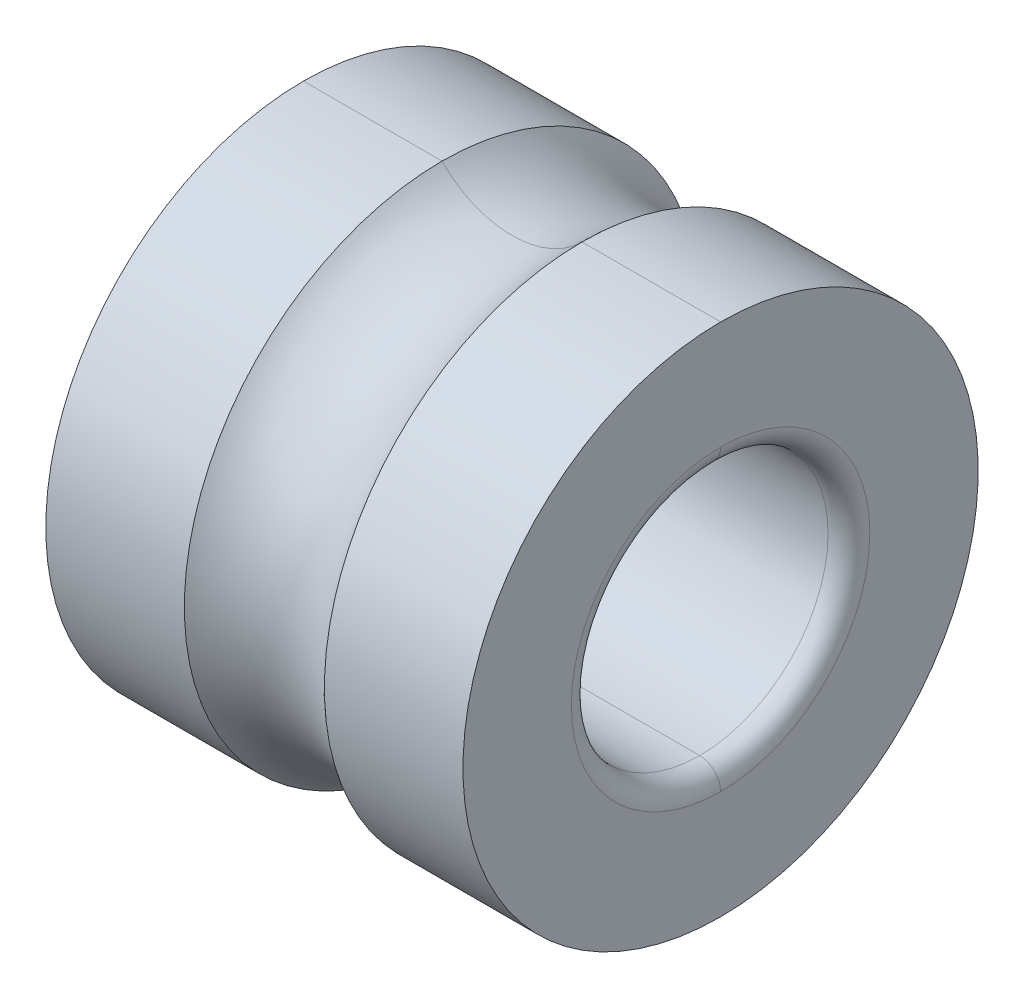
ISO-10303-21;
HEADER;
FILE_DESCRIPTION(('STEP AP214'),'2;1');
FILE_NAME('part.step','',(''),(''),'','','');
FILE_SCHEMA(('AUTOMOTIVE_DESIGN { 1 0 10303 214 1 1 1 1 }'));
ENDSEC;
DATA;
#1=APPLICATION_CONTEXT('core data for automotive mechanical design processes');
#2=APPLICATION_PROTOCOL_DEFINITION('international standard','automotive_design',2000,#1);
#3=PRODUCT_CONTEXT('',#1,'mechanical');
#4=PRODUCT('Part','Part','',(#3));
#5=PRODUCT_RELATED_PRODUCT_CATEGORY('part','',(#4));
#6=PRODUCT_DEFINITION_FORMATION('','',#4);
#7=PRODUCT_DEFINITION_CONTEXT('part definition',#1,'design');
#8=PRODUCT_DEFINITION('design','',#6,#7);
#9=PRODUCT_DEFINITION_SHAPE('','',#8);
#10=(LENGTH_UNIT() NAMED_UNIT(*) SI_UNIT(.MILLI.,.METRE.));
#11=(NAMED_UNIT(*) PLANE_ANGLE_UNIT() SI_UNIT($,.RADIAN.));
#12=(NAMED_UNIT(*) SI_UNIT($,.STERADIAN.) SOLID_ANGLE_UNIT());
#13=UNCERTAINTY_MEASURE_WITH_UNIT(LENGTH_MEASURE(1.E-05),#10,'distance_accuracy_value','');
#14=(GEOMETRIC_REPRESENTATION_CONTEXT(3) GLOBAL_UNCERTAINTY_ASSIGNED_CONTEXT((#13)) GLOBAL_UNIT_ASSIGNED_CONTEXT((#10,
#11,#12)) REPRESENTATION_CONTEXT('',''));
#15=CARTESIAN_POINT('',(0.,0.,0.));
#16=DIRECTION('',(0.,0.,1.));
#17=DIRECTION('',(1.,0.,0.));
#18=AXIS2_PLACEMENT_3D('',#15,#16,#17);
#19=CARTESIAN_POINT('',(-0.544829999999999,0.,0.));
#20=DIRECTION('',(1.,0.,0.));
#21=DIRECTION('',(0.,-1.,0.));
#22=AXIS2_PLACEMENT_3D('',#19,#20,#21);
#23=CYLINDRICAL_SURFACE('',#22,0.3048);
#24=CARTESIAN_POINT('',(-0.44577,0.,0.));
#25=DIRECTION('',(-1.,0.,0.));
#26=DIRECTION('',(0.,1.,0.));
#27=AXIS2_PLACEMENT_3D('',#24,#25,#26);
#28=CIRCLE('',#27,0.3048);
#29=CARTESIAN_POINT('',(-0.44577,0.3048,0.));
#30=VERTEX_POINT('',#29);
#31=CARTESIAN_POINT('',(-0.44577,-0.3048,0.));
#32=VERTEX_POINT('',#31);
#33=EDGE_CURVE('E18',#30,#32,#28,.T.);
#34=ORIENTED_EDGE('',*,*,#33,.T.);
#35=DIRECTION('',(1.,0.,0.));
#36=VECTOR('',#35,1.);
#37=CARTESIAN_POINT('',(-0.44577,-0.3048,0.));
#38=LINE('',#37,#36);
#39=CARTESIAN_POINT('',(0.44577,-0.3048,0.));
#40=VERTEX_POINT('',#39);
#41=EDGE_CURVE('E10',#32,#40,#38,.T.);
#42=ORIENTED_EDGE('',*,*,#41,.T.);
#43=CARTESIAN_POINT('',(0.44577,0.,0.));
#44=DIRECTION('',(-1.,0.,0.));
#45=DIRECTION('',(0.,1.,0.));
#46=AXIS2_PLACEMENT_3D('',#43,#44,#45);
#47=CIRCLE('',#46,0.3048);
#48=CARTESIAN_POINT('',(0.44577,0.3048,0.));
#49=VERTEX_POINT('',#48);
#50=EDGE_CURVE('E83',#49,#40,#47,.T.);
#51=ORIENTED_EDGE('',*,*,#50,.F.);
#52=DIRECTION('',(1.,0.,0.));
#53=VECTOR('',#52,1.);
#54=CARTESIAN_POINT('',(-0.44577,0.3048,0.));
#55=LINE('',#54,#53);
#56=EDGE_CURVE('E23',#30,#49,#55,.T.);
#57=ORIENTED_EDGE('',*,*,#56,.F.);
#58=EDGE_LOOP('',(#34,#42,#51,#57));
#59=FACE_BOUND('',#58,.T.);
#60=ADVANCED_FACE('F15',(#59),#23,.F.);
#61=CARTESIAN_POINT('',(-0.544829999999999,0.,0.));
#62=DIRECTION('',(1.,0.,0.));
#63=DIRECTION('',(0.,-1.,0.));
#64=AXIS2_PLACEMENT_3D('',#61,#62,#63);
#65=CYLINDRICAL_SURFACE('',#64,0.3048);
#66=CARTESIAN_POINT('',(0.44577,0.,0.));
#67=DIRECTION('',(1.,0.,0.));
#68=DIRECTION('',(0.,1.,0.));
#69=AXIS2_PLACEMENT_3D('',#66,#67,#68);
#70=CIRCLE('',#69,0.3048);
#71=EDGE_CURVE('E87',#49,#40,#70,.T.);
#72=ORIENTED_EDGE('',*,*,#71,.T.);
#73=ORIENTED_EDGE('',*,*,#41,.F.);
#74=CARTESIAN_POINT('',(-0.44577,0.,0.));
#75=DIRECTION('',(1.,0.,0.));
#76=DIRECTION('',(0.,1.,0.));
#77=AXIS2_PLACEMENT_3D('',#74,#75,#76);
#78=CIRCLE('',#77,0.3048);
#79=EDGE_CURVE('E90',#30,#32,#78,.T.);
#80=ORIENTED_EDGE('',*,*,#79,.F.);
#81=ORIENTED_EDGE('',*,*,#56,.T.);
#82=EDGE_LOOP('',(#72,#73,#80,#81));
#83=FACE_BOUND('',#82,.T.);
#84=ADVANCED_FACE('F92',(#83),#65,.F.);
#85=CARTESIAN_POINT('',(0.44577,0.,0.));
#86=DIRECTION('',(1.,0.,0.));
#87=DIRECTION('',(0.,-1.,0.));
#88=AXIS2_PLACEMENT_3D('',#85,#86,#87);
#89=TOROIDAL_SURFACE('',#88,0.35433,0.04953);
#90=CARTESIAN_POINT('',(0.4953,0.,0.));
#91=DIRECTION('',(1.,0.,0.));
#92=DIRECTION('',(0.,1.,0.));
#93=AXIS2_PLACEMENT_3D('',#90,#91,#92);
#94=CIRCLE('',#93,0.35433);
#95=CARTESIAN_POINT('',(0.4953,0.35433,0.));
#96=VERTEX_POINT('',#95);
#97=CARTESIAN_POINT('',(0.4953,-0.35433,0.));
#98=VERTEX_POINT('',#97);
#99=EDGE_CURVE('E146',#96,#98,#94,.T.);
#100=ORIENTED_EDGE('',*,*,#99,.T.);
#101=CARTESIAN_POINT('',(0.44577,-0.35433,0.));
#102=DIRECTION('',(0.,0.,-1.));
#103=DIRECTION('',(0.,1.,0.));
#104=AXIS2_PLACEMENT_3D('',#101,#102,#103);
#105=CIRCLE('',#104,0.04953);
#106=EDGE_CURVE('E150',#40,#98,#105,.T.);
#107=ORIENTED_EDGE('',*,*,#106,.F.);
#108=ORIENTED_EDGE('',*,*,#71,.F.);
#109=CARTESIAN_POINT('',(0.44577,0.35433,0.));
#110=DIRECTION('',(0.,0.,1.));
#111=DIRECTION('',(0.,-1.,0.));
#112=AXIS2_PLACEMENT_3D('',#109,#110,#111);
#113=CIRCLE('',#112,0.04953);
#114=EDGE_CURVE('E148',#49,#96,#113,.T.);
#115=ORIENTED_EDGE('',*,*,#114,.T.);
#116=EDGE_LOOP('',(#100,#107,#108,#115));
#117=FACE_BOUND('',#116,.T.);
#118=ADVANCED_FACE('F157',(#117),#89,.T.);
#119=CARTESIAN_POINT('',(0.44577,0.,0.));
#120=DIRECTION('',(1.,0.,0.));
#121=DIRECTION('',(0.,-1.,0.));
#122=AXIS2_PLACEMENT_3D('',#119,#120,#121);
#123=TOROIDAL_SURFACE('',#122,0.35433,0.04953);
#124=ORIENTED_EDGE('',*,*,#50,.T.);
#125=ORIENTED_EDGE('',*,*,#106,.T.);
#126=CARTESIAN_POINT('',(0.4953,0.,0.));
#127=DIRECTION('',(-1.,0.,0.));
#128=DIRECTION('',(0.,1.,0.));
#129=AXIS2_PLACEMENT_3D('',#126,#127,#128);
#130=CIRCLE('',#129,0.35433);
#131=EDGE_CURVE('E143',#96,#98,#130,.T.);
#132=ORIENTED_EDGE('',*,*,#131,.F.);
#133=ORIENTED_EDGE('',*,*,#114,.F.);
#134=EDGE_LOOP('',(#124,#125,#132,#133));
#135=FACE_BOUND('',#134,.T.);
#136=ADVANCED_FACE('F161',(#135),#123,.T.);
#137=CARTESIAN_POINT('',(0.4953,0.,0.));
#138=DIRECTION('',(1.,0.,0.));
#139=DIRECTION('',(0.,-1.,0.));
#140=AXIS2_PLACEMENT_3D('',#137,#138,#139);
#141=PLANE('',#140);
#142=ORIENTED_EDGE('',*,*,#99,.F.);
#143=ORIENTED_EDGE('',*,*,#131,.T.);
#144=EDGE_LOOP('',(#142,#143));
#145=FACE_BOUND('',#144,.T.);
#146=CARTESIAN_POINT('',(0.495300000000001,0.,0.));
#147=DIRECTION('',(-1.,0.,0.));
#148=DIRECTION('',(0.,1.,0.));
#149=AXIS2_PLACEMENT_3D('',#146,#147,#148);
#150=CIRCLE('',#149,0.6117463);
#151=CARTESIAN_POINT('',(0.4953,0.6117463,0.));
#152=VERTEX_POINT('',#151);
#153=CARTESIAN_POINT('',(0.4953,-0.6117463,0.));
#154=VERTEX_POINT('',#153);
#155=EDGE_CURVE('E138',#152,#154,#150,.T.);
#156=ORIENTED_EDGE('',*,*,#155,.F.);
#157=CARTESIAN_POINT('',(0.495300000000001,0.,0.));
#158=DIRECTION('',(1.,0.,0.));
#159=DIRECTION('',(0.,1.,0.));
#160=AXIS2_PLACEMENT_3D('',#157,#158,#159);
#161=CIRCLE('',#160,0.6117463);
#162=EDGE_CURVE('E141',#152,#154,#161,.T.);
#163=ORIENTED_EDGE('',*,*,#162,.T.);
#164=EDGE_LOOP('',(#156,#163));
#165=FACE_BOUND('',#164,.T.);
#166=ADVANCED_FACE('F163',(#145,#165),#141,.T.);
#167=CARTESIAN_POINT('',(-0.544829999999999,0.,0.));
#168=DIRECTION('',(1.,0.,0.));
#169=DIRECTION('',(0.,-1.,0.));
#170=AXIS2_PLACEMENT_3D('',#167,#168,#169);
#171=CYLINDRICAL_SURFACE('',#170,0.6117463);
#172=CARTESIAN_POINT('',(0.166246026530892,0.,0.));
#173=DIRECTION('',(1.,0.,0.));
#174=DIRECTION('',(0.,1.,0.));
#175=AXIS2_PLACEMENT_3D('',#172,#173,#174);
#176=CIRCLE('',#175,0.6117463);
#177=CARTESIAN_POINT('',(0.166246026530892,0.6117463,0.));
#178=VERTEX_POINT('',#177);
#179=CARTESIAN_POINT('',(0.166246026530892,-0.6117463,0.));
#180=VERTEX_POINT('',#179);
#181=EDGE_CURVE('E124',#178,#180,#176,.T.);
#182=ORIENTED_EDGE('',*,*,#181,.T.);
#183=DIRECTION('',(-1.,0.,0.));
#184=VECTOR('',#183,1.);
#185=CARTESIAN_POINT('',(0.4953,-0.6117463,0.));
#186=LINE('',#185,#184);
#187=EDGE_CURVE('E135',#154,#180,#186,.T.);
#188=ORIENTED_EDGE('',*,*,#187,.F.);
#189=ORIENTED_EDGE('',*,*,#162,.F.);
#190=DIRECTION('',(-1.,0.,0.));
#191=VECTOR('',#190,1.);
#192=CARTESIAN_POINT('',(0.4953,0.6117463,0.));
#193=LINE('',#192,#191);
#194=EDGE_CURVE('E133',#152,#178,#193,.T.);
#195=ORIENTED_EDGE('',*,*,#194,.T.);
#196=EDGE_LOOP('',(#182,#188,#189,#195));
#197=FACE_BOUND('',#196,.T.);
#198=ADVANCED_FACE('F166',(#197),#171,.T.);
#199=CARTESIAN_POINT('',(-0.544829999999999,0.,0.));
#200=DIRECTION('',(1.,0.,0.));
#201=DIRECTION('',(0.,-1.,0.));
#202=AXIS2_PLACEMENT_3D('',#199,#200,#201);
#203=CYLINDRICAL_SURFACE('',#202,0.6117463);
#204=ORIENTED_EDGE('',*,*,#155,.T.);
#205=ORIENTED_EDGE('',*,*,#187,.T.);
#206=CARTESIAN_POINT('',(0.166246026530892,0.,0.));
#207=DIRECTION('',(-1.,0.,0.));
#208=DIRECTION('',(0.,1.,0.));
#209=AXIS2_PLACEMENT_3D('',#206,#207,#208);
#210=CIRCLE('',#209,0.6117463);
#211=EDGE_CURVE('E130',#178,#180,#210,.T.);
#212=ORIENTED_EDGE('',*,*,#211,.F.);
#213=ORIENTED_EDGE('',*,*,#194,.F.);
#214=EDGE_LOOP('',(#204,#205,#212,#213));
#215=FACE_BOUND('',#214,.T.);
#216=ADVANCED_FACE('F174',(#215),#203,.T.);
#217=CARTESIAN_POINT('',(0.,0.,0.));
#218=DIRECTION('',(1.,0.,0.));
#219=DIRECTION('',(0.,-1.,0.));
#220=AXIS2_PLACEMENT_3D('',#217,#218,#219);
#221=TOROIDAL_SURFACE('',#220,0.7747,0.232791);
#222=ORIENTED_EDGE('',*,*,#211,.T.);
#223=CARTESIAN_POINT('',(0.,-0.7747,0.));
#224=DIRECTION('',(0.,0.,1.));
#225=DIRECTION('',(0.714142842854284,0.700000000000001,0.));
#226=AXIS2_PLACEMENT_3D('',#223,#224,#225);
#227=CIRCLE('',#226,0.232791);
#228=CARTESIAN_POINT('',(-0.166246026530892,-0.6117463,0.));
#229=VERTEX_POINT('',#228);
#230=EDGE_CURVE('E126',#180,#229,#227,.T.);
#231=ORIENTED_EDGE('',*,*,#230,.T.);
#232=CARTESIAN_POINT('',(-0.166246026530892,0.,0.));
#233=DIRECTION('',(-1.,0.,0.));
#234=DIRECTION('',(0.,1.,0.));
#235=AXIS2_PLACEMENT_3D('',#232,#233,#234);
#236=CIRCLE('',#235,0.6117463);
#237=CARTESIAN_POINT('',(-0.166246026530892,0.6117463,0.));
#238=VERTEX_POINT('',#237);
#239=EDGE_CURVE('E117',#238,#229,#236,.T.);
#240=ORIENTED_EDGE('',*,*,#239,.F.);
#241=CARTESIAN_POINT('',(0.,0.7747,0.));
#242=DIRECTION('',(0.,0.,-1.));
#243=DIRECTION('',(0.714142842854284,-0.700000000000001,0.));
#244=AXIS2_PLACEMENT_3D('',#241,#242,#243);
#245=CIRCLE('',#244,0.232791);
#246=EDGE_CURVE('E123',#178,#238,#245,.T.);
#247=ORIENTED_EDGE('',*,*,#246,.F.);
#248=EDGE_LOOP('',(#222,#231,#240,#247));
#249=FACE_BOUND('',#248,.T.);
#250=ADVANCED_FACE('F179',(#249),#221,.F.);
#251=CARTESIAN_POINT('',(0.,0.,0.));
#252=DIRECTION('',(1.,0.,0.));
#253=DIRECTION('',(0.,-1.,0.));
#254=AXIS2_PLACEMENT_3D('',#251,#252,#253);
#255=TOROIDAL_SURFACE('',#254,0.7747,0.232791);
#256=CARTESIAN_POINT('',(-0.166246026530892,0.,0.));
#257=DIRECTION('',(1.,0.,0.));
#258=DIRECTION('',(0.,1.,0.));
#259=AXIS2_PLACEMENT_3D('',#256,#257,#258);
#260=CIRCLE('',#259,0.6117463);
#261=EDGE_CURVE('E120',#238,#229,#260,.T.);
#262=ORIENTED_EDGE('',*,*,#261,.T.);
#263=ORIENTED_EDGE('',*,*,#230,.F.);
#264=ORIENTED_EDGE('',*,*,#181,.F.);
#265=ORIENTED_EDGE('',*,*,#246,.T.);
#266=EDGE_LOOP('',(#262,#263,#264,#265));
#267=FACE_BOUND('',#266,.T.);
#268=ADVANCED_FACE('F182',(#267),#255,.F.);
#269=CARTESIAN_POINT('',(-0.544829999999999,0.,0.));
#270=DIRECTION('',(1.,0.,0.));
#271=DIRECTION('',(0.,-1.,0.));
#272=AXIS2_PLACEMENT_3D('',#269,#270,#271);
#273=CYLINDRICAL_SURFACE('',#272,0.6117463);
#274=CARTESIAN_POINT('',(-0.4953,0.,0.));
#275=DIRECTION('',(1.,0.,0.));
#276=DIRECTION('',(0.,1.,0.));
#277=AXIS2_PLACEMENT_3D('',#274,#275,#276);
#278=CIRCLE('',#277,0.6117463);
#279=CARTESIAN_POINT('',(-0.4953,0.6117463,0.));
#280=VERTEX_POINT('',#279);
#281=CARTESIAN_POINT('',(-0.4953,-0.6117463,0.));
#282=VERTEX_POINT('',#281);
#283=EDGE_CURVE('E37',#280,#282,#278,.T.);
#284=ORIENTED_EDGE('',*,*,#283,.T.);
#285=DIRECTION('',(-1.,0.,0.));
#286=VECTOR('',#285,1.);
#287=CARTESIAN_POINT('',(-0.166246026530892,-0.6117463,0.));
#288=LINE('',#287,#286);
#289=EDGE_CURVE('E115',#229,#282,#288,.T.);
#290=ORIENTED_EDGE('',*,*,#289,.F.);
#291=ORIENTED_EDGE('',*,*,#261,.F.);
#292=DIRECTION('',(-1.,0.,0.));
#293=VECTOR('',#292,1.);
#294=CARTESIAN_POINT('',(-0.166246026530892,0.6117463,0.));
#295=LINE('',#294,#293);
#296=EDGE_CURVE('E113',#238,#280,#295,.T.);
#297=ORIENTED_EDGE('',*,*,#296,.T.);
#298=EDGE_LOOP('',(#284,#290,#291,#297));
#299=FACE_BOUND('',#298,.T.);
#300=ADVANCED_FACE('F184',(#299),#273,.T.);
#301=CARTESIAN_POINT('',(-0.544829999999999,0.,0.));
#302=DIRECTION('',(1.,0.,0.));
#303=DIRECTION('',(0.,-1.,0.));
#304=AXIS2_PLACEMENT_3D('',#301,#302,#303);
#305=CYLINDRICAL_SURFACE('',#304,0.6117463);
#306=ORIENTED_EDGE('',*,*,#239,.T.);
#307=ORIENTED_EDGE('',*,*,#289,.T.);
#308=CARTESIAN_POINT('',(-0.4953,0.,0.));
#309=DIRECTION('',(-1.,0.,0.));
#310=DIRECTION('',(0.,1.,0.));
#311=AXIS2_PLACEMENT_3D('',#308,#309,#310);
#312=CIRCLE('',#311,0.6117463);
#313=EDGE_CURVE('E95',#280,#282,#312,.T.);
#314=ORIENTED_EDGE('',*,*,#313,.F.);
#315=ORIENTED_EDGE('',*,*,#296,.F.);
#316=EDGE_LOOP('',(#306,#307,#314,#315));
#317=FACE_BOUND('',#316,.T.);
#318=ADVANCED_FACE('F187',(#317),#305,.T.);
#319=CARTESIAN_POINT('',(-0.4953,0.,0.));
#320=DIRECTION('',(1.,0.,0.));
#321=DIRECTION('',(0.,-1.,0.));
#322=AXIS2_PLACEMENT_3D('',#319,#320,#321);
#323=PLANE('',#322);
#324=CARTESIAN_POINT('',(-0.4953,0.,0.));
#325=DIRECTION('',(-1.,0.,0.));
#326=DIRECTION('',(0.,1.,0.));
#327=AXIS2_PLACEMENT_3D('',#324,#325,#326);
#328=CIRCLE('',#327,0.35433);
#329=CARTESIAN_POINT('',(-0.4953,0.35433,0.));
#330=VERTEX_POINT('',#329);
#331=CARTESIAN_POINT('',(-0.4953,-0.35433,0.));
#332=VERTEX_POINT('',#331);
#333=EDGE_CURVE('E105',#330,#332,#328,.T.);
#334=ORIENTED_EDGE('',*,*,#333,.F.);
#335=CARTESIAN_POINT('',(-0.4953,0.,0.));
#336=DIRECTION('',(1.,0.,0.));
#337=DIRECTION('',(0.,1.,0.));
#338=AXIS2_PLACEMENT_3D('',#335,#336,#337);
#339=CIRCLE('',#338,0.35433);
#340=EDGE_CURVE('E29',#330,#332,#339,.T.);
#341=ORIENTED_EDGE('',*,*,#340,.T.);
#342=EDGE_LOOP('',(#334,#341));
#343=FACE_BOUND('',#342,.T.);
#344=ORIENTED_EDGE('',*,*,#283,.F.);
#345=ORIENTED_EDGE('',*,*,#313,.T.);
#346=EDGE_LOOP('',(#344,#345));
#347=FACE_BOUND('',#346,.T.);
#348=ADVANCED_FACE('F189',(#343,#347),#323,.F.);
#349=CARTESIAN_POINT('',(-0.44577,0.,0.));
#350=DIRECTION('',(1.,0.,0.));
#351=DIRECTION('',(0.,-1.,0.));
#352=AXIS2_PLACEMENT_3D('',#349,#350,#351);
#353=TOROIDAL_SURFACE('',#352,0.35433,0.04953);
#354=ORIENTED_EDGE('',*,*,#79,.T.);
#355=CARTESIAN_POINT('',(-0.44577,-0.35433,0.));
#356=DIRECTION('',(0.,0.,-1.));
#357=DIRECTION('',(-1.,0.,0.));
#358=AXIS2_PLACEMENT_3D('',#355,#356,#357);
#359=CIRCLE('',#358,0.04953);
#360=EDGE_CURVE('E104',#332,#32,#359,.T.);
#361=ORIENTED_EDGE('',*,*,#360,.F.);
#362=ORIENTED_EDGE('',*,*,#340,.F.);
#363=CARTESIAN_POINT('',(-0.44577,0.35433,0.));
#364=DIRECTION('',(0.,0.,1.));
#365=DIRECTION('',(-1.,0.,0.));
#366=AXIS2_PLACEMENT_3D('',#363,#364,#365);
#367=CIRCLE('',#366,0.04953);
#368=EDGE_CURVE('E98',#330,#30,#367,.T.);
#369=ORIENTED_EDGE('',*,*,#368,.T.);
#370=EDGE_LOOP('',(#354,#361,#362,#369));
#371=FACE_BOUND('',#370,.T.);
#372=ADVANCED_FACE('F99',(#371),#353,.T.);
#373=CARTESIAN_POINT('',(-0.44577,0.,0.));
#374=DIRECTION('',(1.,0.,0.));
#375=DIRECTION('',(0.,-1.,0.));
#376=AXIS2_PLACEMENT_3D('',#373,#374,#375);
#377=TOROIDAL_SURFACE('',#376,0.35433,0.04953);
#378=ORIENTED_EDGE('',*,*,#333,.T.);
#379=ORIENTED_EDGE('',*,*,#360,.T.);
#380=ORIENTED_EDGE('',*,*,#33,.F.);
#381=ORIENTED_EDGE('',*,*,#368,.F.);
#382=EDGE_LOOP('',(#378,#379,#380,#381));
#383=FACE_BOUND('',#382,.T.);
#384=ADVANCED_FACE('F103',(#383),#377,.T.);
#385=CLOSED_SHELL('',(#60,#84,#118,#136,#166,#198,#216,#250,#268,#300,#318,#348,#372,#384));
#386=MANIFOLD_SOLID_BREP('B1',#385);
#387=ADVANCED_BREP_SHAPE_REPRESENTATION('',(#18,#386),#14);
#388=SHAPE_DEFINITION_REPRESENTATION(#9,#387);
ENDSEC;
END-ISO-10303-21;
